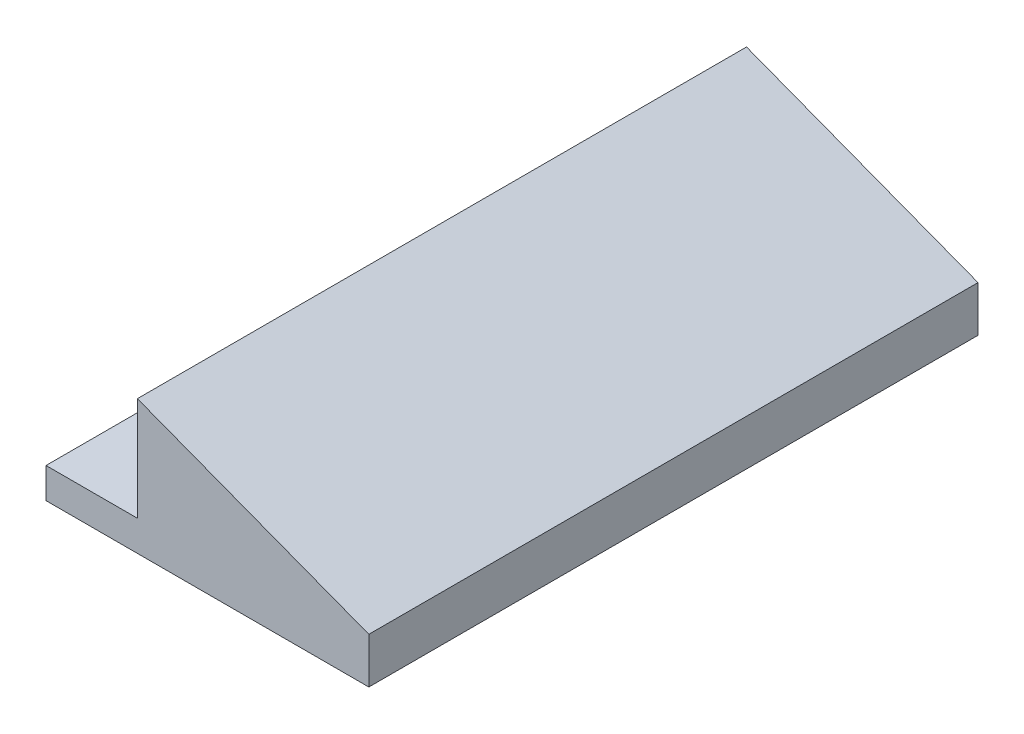
ISO-10303-21;
HEADER;
FILE_DESCRIPTION(('STEP AP214'),'2;1');
FILE_NAME('part.step','',(''),(''),'','','');
FILE_SCHEMA(('AUTOMOTIVE_DESIGN { 1 0 10303 214 1 1 1 1 }'));
ENDSEC;
DATA;
#1=APPLICATION_CONTEXT('core data for automotive mechanical design processes');
#2=APPLICATION_PROTOCOL_DEFINITION('international standard','automotive_design',2000,#1);
#3=PRODUCT_CONTEXT('',#1,'mechanical');
#4=PRODUCT('Part','Part','',(#3));
#5=PRODUCT_RELATED_PRODUCT_CATEGORY('part','',(#4));
#6=PRODUCT_DEFINITION_FORMATION('','',#4);
#7=PRODUCT_DEFINITION_CONTEXT('part definition',#1,'design');
#8=PRODUCT_DEFINITION('design','',#6,#7);
#9=PRODUCT_DEFINITION_SHAPE('','',#8);
#10=(LENGTH_UNIT() NAMED_UNIT(*) SI_UNIT(.MILLI.,.METRE.));
#11=(NAMED_UNIT(*) PLANE_ANGLE_UNIT() SI_UNIT($,.RADIAN.));
#12=(NAMED_UNIT(*) SI_UNIT($,.STERADIAN.) SOLID_ANGLE_UNIT());
#13=UNCERTAINTY_MEASURE_WITH_UNIT(LENGTH_MEASURE(1.E-05),#10,'distance_accuracy_value','');
#14=(GEOMETRIC_REPRESENTATION_CONTEXT(3) GLOBAL_UNCERTAINTY_ASSIGNED_CONTEXT((#13)) GLOBAL_UNIT_ASSIGNED_CONTEXT((#10,
#11,#12)) REPRESENTATION_CONTEXT('',''));
#15=CARTESIAN_POINT('',(0.,0.,0.));
#16=DIRECTION('',(0.,0.,1.));
#17=DIRECTION('',(1.,0.,0.));
#18=AXIS2_PLACEMENT_3D('',#15,#16,#17);
#19=CARTESIAN_POINT('',(38.,0.,100.));
#20=DIRECTION('',(-1.,0.,0.));
#21=DIRECTION('',(0.,0.,1.));
#22=AXIS2_PLACEMENT_3D('',#19,#20,#21);
#23=PLANE('',#22);
#24=DIRECTION('',(0.,1.,0.));
#25=VECTOR('',#24,1.);
#26=CARTESIAN_POINT('',(38.,0.,0.));
#27=LINE('',#26,#25);
#28=CARTESIAN_POINT('',(38.,0.,0.));
#29=VERTEX_POINT('',#28);
#30=CARTESIAN_POINT('',(38.,7.5,0.));
#31=VERTEX_POINT('',#30);
#32=EDGE_CURVE('E123',#29,#31,#27,.T.);
#33=ORIENTED_EDGE('',*,*,#32,.T.);
#34=DIRECTION('',(0.,0.,-1.));
#35=VECTOR('',#34,1.);
#36=CARTESIAN_POINT('',(38.,7.5,100.));
#37=LINE('',#36,#35);
#38=CARTESIAN_POINT('',(38.,7.5,100.));
#39=VERTEX_POINT('',#38);
#40=EDGE_CURVE('E42',#39,#31,#37,.T.);
#41=ORIENTED_EDGE('',*,*,#40,.F.);
#42=DIRECTION('',(0.,1.,0.));
#43=VECTOR('',#42,1.);
#44=CARTESIAN_POINT('',(38.,0.,100.));
#45=LINE('',#44,#43);
#46=CARTESIAN_POINT('',(38.,0.,100.));
#47=VERTEX_POINT('',#46);
#48=EDGE_CURVE('E89',#47,#39,#45,.T.);
#49=ORIENTED_EDGE('',*,*,#48,.F.);
#50=DIRECTION('',(0.,0.,-1.));
#51=VECTOR('',#50,1.);
#52=CARTESIAN_POINT('',(38.,0.,100.));
#53=LINE('',#52,#51);
#54=EDGE_CURVE('E11',#47,#29,#53,.T.);
#55=ORIENTED_EDGE('',*,*,#54,.T.);
#56=EDGE_LOOP('',(#33,#41,#49,#55));
#57=FACE_BOUND('',#56,.T.);
#58=ADVANCED_FACE('F33',(#57),#23,.F.);
#59=CARTESIAN_POINT('',(0.,22.,100.));
#60=DIRECTION('',(-0.356506481980512,-0.934292849328239,0.));
#61=DIRECTION('',(0.934292849328239,-0.356506481980512,0.));
#62=AXIS2_PLACEMENT_3D('',#59,#60,#61);
#63=PLANE('',#62);
#64=DIRECTION('',(-0.934292849328239,0.356506481980512,0.));
#65=VECTOR('',#64,1.);
#66=CARTESIAN_POINT('',(0.,22.,0.));
#67=LINE('',#66,#65);
#68=CARTESIAN_POINT('',(0.,22.,0.));
#69=VERTEX_POINT('',#68);
#70=EDGE_CURVE('E125',#31,#69,#67,.T.);
#71=ORIENTED_EDGE('',*,*,#70,.T.);
#72=DIRECTION('',(0.,0.,-1.));
#73=VECTOR('',#72,1.);
#74=CARTESIAN_POINT('',(0.,22.,100.));
#75=LINE('',#74,#73);
#76=CARTESIAN_POINT('',(0.,22.,100.));
#77=VERTEX_POINT('',#76);
#78=EDGE_CURVE('E112',#77,#69,#75,.T.);
#79=ORIENTED_EDGE('',*,*,#78,.F.);
#80=DIRECTION('',(-0.934292849328239,0.356506481980512,0.));
#81=VECTOR('',#80,1.);
#82=CARTESIAN_POINT('',(0.,22.,100.));
#83=LINE('',#82,#81);
#84=EDGE_CURVE('E103',#39,#77,#83,.T.);
#85=ORIENTED_EDGE('',*,*,#84,.F.);
#86=ORIENTED_EDGE('',*,*,#40,.T.);
#87=EDGE_LOOP('',(#71,#79,#85,#86));
#88=FACE_BOUND('',#87,.T.);
#89=ADVANCED_FACE('F154',(#88),#63,.F.);
#90=CARTESIAN_POINT('',(0.,5.,100.));
#91=DIRECTION('',(1.,0.,0.));
#92=DIRECTION('',(0.,0.,-1.));
#93=AXIS2_PLACEMENT_3D('',#90,#91,#92);
#94=PLANE('',#93);
#95=DIRECTION('',(0.,-1.,0.));
#96=VECTOR('',#95,1.);
#97=CARTESIAN_POINT('',(0.,5.,0.));
#98=LINE('',#97,#96);
#99=CARTESIAN_POINT('',(0.,5.,0.));
#100=VERTEX_POINT('',#99);
#101=EDGE_CURVE('E111',#69,#100,#98,.T.);
#102=ORIENTED_EDGE('',*,*,#101,.T.);
#103=DIRECTION('',(0.,0.,-1.));
#104=VECTOR('',#103,1.);
#105=CARTESIAN_POINT('',(0.,5.,100.));
#106=LINE('',#105,#104);
#107=CARTESIAN_POINT('',(0.,5.,100.));
#108=VERTEX_POINT('',#107);
#109=EDGE_CURVE('E108',#108,#100,#106,.T.);
#110=ORIENTED_EDGE('',*,*,#109,.F.);
#111=DIRECTION('',(0.,-1.,0.));
#112=VECTOR('',#111,1.);
#113=CARTESIAN_POINT('',(0.,5.,100.));
#114=LINE('',#113,#112);
#115=EDGE_CURVE('E97',#77,#108,#114,.T.);
#116=ORIENTED_EDGE('',*,*,#115,.F.);
#117=ORIENTED_EDGE('',*,*,#78,.T.);
#118=EDGE_LOOP('',(#102,#110,#116,#117));
#119=FACE_BOUND('',#118,.T.);
#120=ADVANCED_FACE('F109',(#119),#94,.F.);
#121=CARTESIAN_POINT('',(-15.,5.,100.));
#122=DIRECTION('',(0.,-1.,0.));
#123=DIRECTION('',(1.,0.,0.));
#124=AXIS2_PLACEMENT_3D('',#121,#122,#123);
#125=PLANE('',#124);
#126=CARTESIAN_POINT('',(-7.5,5.,80.));
#127=DIRECTION('',(0.,1.,0.));
#128=DIRECTION('',(-1.,0.,0.));
#129=AXIS2_PLACEMENT_3D('',#126,#127,#128);
#130=CIRCLE('',#129,2.);
#131=CARTESIAN_POINT('',(-9.5,5.,80.));
#132=VERTEX_POINT('',#131);
#133=EDGE_CURVE('E138',#132,#132,#130,.T.);
#134=ORIENTED_EDGE('',*,*,#133,.F.);
#135=EDGE_LOOP('',(#134));
#136=FACE_BOUND('',#135,.T.);
#137=CARTESIAN_POINT('',(-7.5,5.,20.));
#138=DIRECTION('',(0.,1.,0.));
#139=DIRECTION('',(-1.,0.,0.));
#140=AXIS2_PLACEMENT_3D('',#137,#138,#139);
#141=CIRCLE('',#140,2.);
#142=CARTESIAN_POINT('',(-9.5,5.,20.));
#143=VERTEX_POINT('',#142);
#144=EDGE_CURVE('E143',#143,#143,#141,.T.);
#145=ORIENTED_EDGE('',*,*,#144,.F.);
#146=EDGE_LOOP('',(#145));
#147=FACE_BOUND('',#146,.T.);
#148=DIRECTION('',(-1.,0.,0.));
#149=VECTOR('',#148,1.);
#150=CARTESIAN_POINT('',(-15.,5.,0.));
#151=LINE('',#150,#149);
#152=CARTESIAN_POINT('',(-15.,5.,0.));
#153=VERTEX_POINT('',#152);
#154=EDGE_CURVE('E75',#100,#153,#151,.T.);
#155=ORIENTED_EDGE('',*,*,#154,.T.);
#156=DIRECTION('',(0.,0.,-1.));
#157=VECTOR('',#156,1.);
#158=CARTESIAN_POINT('',(-15.,5.,100.));
#159=LINE('',#158,#157);
#160=CARTESIAN_POINT('',(-15.,5.,100.));
#161=VERTEX_POINT('',#160);
#162=EDGE_CURVE('E113',#161,#153,#159,.T.);
#163=ORIENTED_EDGE('',*,*,#162,.F.);
#164=DIRECTION('',(-1.,0.,0.));
#165=VECTOR('',#164,1.);
#166=CARTESIAN_POINT('',(-15.,5.,100.));
#167=LINE('',#166,#165);
#168=EDGE_CURVE('E101',#108,#161,#167,.T.);
#169=ORIENTED_EDGE('',*,*,#168,.F.);
#170=ORIENTED_EDGE('',*,*,#109,.T.);
#171=EDGE_LOOP('',(#155,#163,#169,#170));
#172=FACE_BOUND('',#171,.T.);
#173=ADVANCED_FACE('F115',(#136,#147,#172),#125,.F.);
#174=CARTESIAN_POINT('',(-15.,0.,100.));
#175=DIRECTION('',(1.,0.,0.));
#176=DIRECTION('',(0.,0.,-1.));
#177=AXIS2_PLACEMENT_3D('',#174,#175,#176);
#178=PLANE('',#177);
#179=DIRECTION('',(0.,-1.,0.));
#180=VECTOR('',#179,1.);
#181=CARTESIAN_POINT('',(-15.,0.,0.));
#182=LINE('',#181,#180);
#183=CARTESIAN_POINT('',(-15.,0.,0.));
#184=VERTEX_POINT('',#183);
#185=EDGE_CURVE('E82',#153,#184,#182,.T.);
#186=ORIENTED_EDGE('',*,*,#185,.T.);
#187=DIRECTION('',(0.,0.,-1.));
#188=VECTOR('',#187,1.);
#189=CARTESIAN_POINT('',(-15.,0.,100.));
#190=LINE('',#189,#188);
#191=CARTESIAN_POINT('',(-15.,0.,100.));
#192=VERTEX_POINT('',#191);
#193=EDGE_CURVE('E119',#192,#184,#190,.T.);
#194=ORIENTED_EDGE('',*,*,#193,.F.);
#195=DIRECTION('',(0.,-1.,0.));
#196=VECTOR('',#195,1.);
#197=CARTESIAN_POINT('',(-15.,0.,100.));
#198=LINE('',#197,#196);
#199=EDGE_CURVE('E117',#161,#192,#198,.T.);
#200=ORIENTED_EDGE('',*,*,#199,.F.);
#201=ORIENTED_EDGE('',*,*,#162,.T.);
#202=EDGE_LOOP('',(#186,#194,#200,#201));
#203=FACE_BOUND('',#202,.T.);
#204=ADVANCED_FACE('F159',(#203),#178,.F.);
#205=CARTESIAN_POINT('',(0.,0.,100.));
#206=DIRECTION('',(0.,1.,0.));
#207=DIRECTION('',(-1.,0.,0.));
#208=AXIS2_PLACEMENT_3D('',#205,#206,#207);
#209=PLANE('',#208);
#210=CARTESIAN_POINT('',(-7.5,0.,80.));
#211=DIRECTION('',(0.,1.,0.));
#212=DIRECTION('',(-1.,0.,0.));
#213=AXIS2_PLACEMENT_3D('',#210,#211,#212);
#214=CIRCLE('',#213,2.);
#215=CARTESIAN_POINT('',(-9.5,0.,80.));
#216=VERTEX_POINT('',#215);
#217=EDGE_CURVE('E36',#216,#216,#214,.T.);
#218=ORIENTED_EDGE('',*,*,#217,.T.);
#219=EDGE_LOOP('',(#218));
#220=FACE_BOUND('',#219,.T.);
#221=CARTESIAN_POINT('',(-7.5,0.,20.));
#222=DIRECTION('',(0.,1.,0.));
#223=DIRECTION('',(-1.,0.,0.));
#224=AXIS2_PLACEMENT_3D('',#221,#222,#223);
#225=CIRCLE('',#224,2.);
#226=CARTESIAN_POINT('',(-9.5,0.,20.));
#227=VERTEX_POINT('',#226);
#228=EDGE_CURVE('E136',#227,#227,#225,.T.);
#229=ORIENTED_EDGE('',*,*,#228,.T.);
#230=EDGE_LOOP('',(#229));
#231=FACE_BOUND('',#230,.T.);
#232=DIRECTION('',(1.,0.,0.));
#233=VECTOR('',#232,1.);
#234=CARTESIAN_POINT('',(0.,0.,0.));
#235=LINE('',#234,#233);
#236=EDGE_CURVE('E130',#184,#29,#235,.T.);
#237=ORIENTED_EDGE('',*,*,#236,.T.);
#238=ORIENTED_EDGE('',*,*,#54,.F.);
#239=DIRECTION('',(1.,0.,0.));
#240=VECTOR('',#239,1.);
#241=CARTESIAN_POINT('',(38.,0.,100.));
#242=LINE('',#241,#240);
#243=EDGE_CURVE('E51',#192,#47,#242,.T.);
#244=ORIENTED_EDGE('',*,*,#243,.F.);
#245=ORIENTED_EDGE('',*,*,#193,.T.);
#246=EDGE_LOOP('',(#237,#238,#244,#245));
#247=FACE_BOUND('',#246,.T.);
#248=ADVANCED_FACE('F158',(#220,#231,#247),#209,.F.);
#249=CARTESIAN_POINT('',(0.,0.,100.));
#250=DIRECTION('',(0.,0.,-1.));
#251=DIRECTION('',(-1.,0.,0.));
#252=AXIS2_PLACEMENT_3D('',#249,#250,#251);
#253=PLANE('',#252);
#254=ORIENTED_EDGE('',*,*,#243,.T.);
#255=ORIENTED_EDGE('',*,*,#48,.T.);
#256=ORIENTED_EDGE('',*,*,#84,.T.);
#257=ORIENTED_EDGE('',*,*,#115,.T.);
#258=ORIENTED_EDGE('',*,*,#168,.T.);
#259=ORIENTED_EDGE('',*,*,#199,.T.);
#260=EDGE_LOOP('',(#254,#255,#256,#257,#258,#259));
#261=FACE_BOUND('',#260,.T.);
#262=ADVANCED_FACE('F99',(#261),#253,.F.);
#263=CARTESIAN_POINT('',(0.,0.,0.));
#264=DIRECTION('',(0.,0.,-1.));
#265=DIRECTION('',(-1.,0.,0.));
#266=AXIS2_PLACEMENT_3D('',#263,#264,#265);
#267=PLANE('',#266);
#268=ORIENTED_EDGE('',*,*,#32,.F.);
#269=ORIENTED_EDGE('',*,*,#236,.F.);
#270=ORIENTED_EDGE('',*,*,#185,.F.);
#271=ORIENTED_EDGE('',*,*,#154,.F.);
#272=ORIENTED_EDGE('',*,*,#101,.F.);
#273=ORIENTED_EDGE('',*,*,#70,.F.);
#274=EDGE_LOOP('',(#268,#269,#270,#271,#272,#273));
#275=FACE_BOUND('',#274,.T.);
#276=ADVANCED_FACE('F156',(#275),#267,.T.);
#277=CARTESIAN_POINT('',(-7.49999999999999,-95.,20.));
#278=DIRECTION('',(0.,1.,0.));
#279=DIRECTION('',(-1.,0.,0.));
#280=AXIS2_PLACEMENT_3D('',#277,#278,#279);
#281=CYLINDRICAL_SURFACE('',#280,2.);
#282=ORIENTED_EDGE('',*,*,#144,.T.);
#283=EDGE_LOOP('',(#282));
#284=FACE_BOUND('',#283,.T.);
#285=ORIENTED_EDGE('',*,*,#228,.F.);
#286=EDGE_LOOP('',(#285));
#287=FACE_BOUND('',#286,.T.);
#288=ADVANCED_FACE('F204',(#284,#287),#281,.F.);
#289=CARTESIAN_POINT('',(-7.49999999999999,-95.,80.));
#290=DIRECTION('',(0.,1.,0.));
#291=DIRECTION('',(-1.,0.,0.));
#292=AXIS2_PLACEMENT_3D('',#289,#290,#291);
#293=CYLINDRICAL_SURFACE('',#292,2.);
#294=ORIENTED_EDGE('',*,*,#133,.T.);
#295=EDGE_LOOP('',(#294));
#296=FACE_BOUND('',#295,.T.);
#297=ORIENTED_EDGE('',*,*,#217,.F.);
#298=EDGE_LOOP('',(#297));
#299=FACE_BOUND('',#298,.T.);
#300=ADVANCED_FACE('F209',(#296,#299),#293,.F.);
#301=CLOSED_SHELL('',(#58,#89,#120,#173,#204,#248,#262,#276,#288,#300));
#302=MANIFOLD_SOLID_BREP('B2',#301);
#303=ADVANCED_BREP_SHAPE_REPRESENTATION('',(#18,#302),#14);
#304=SHAPE_DEFINITION_REPRESENTATION(#9,#303);
ENDSEC;
END-ISO-10303-21;
